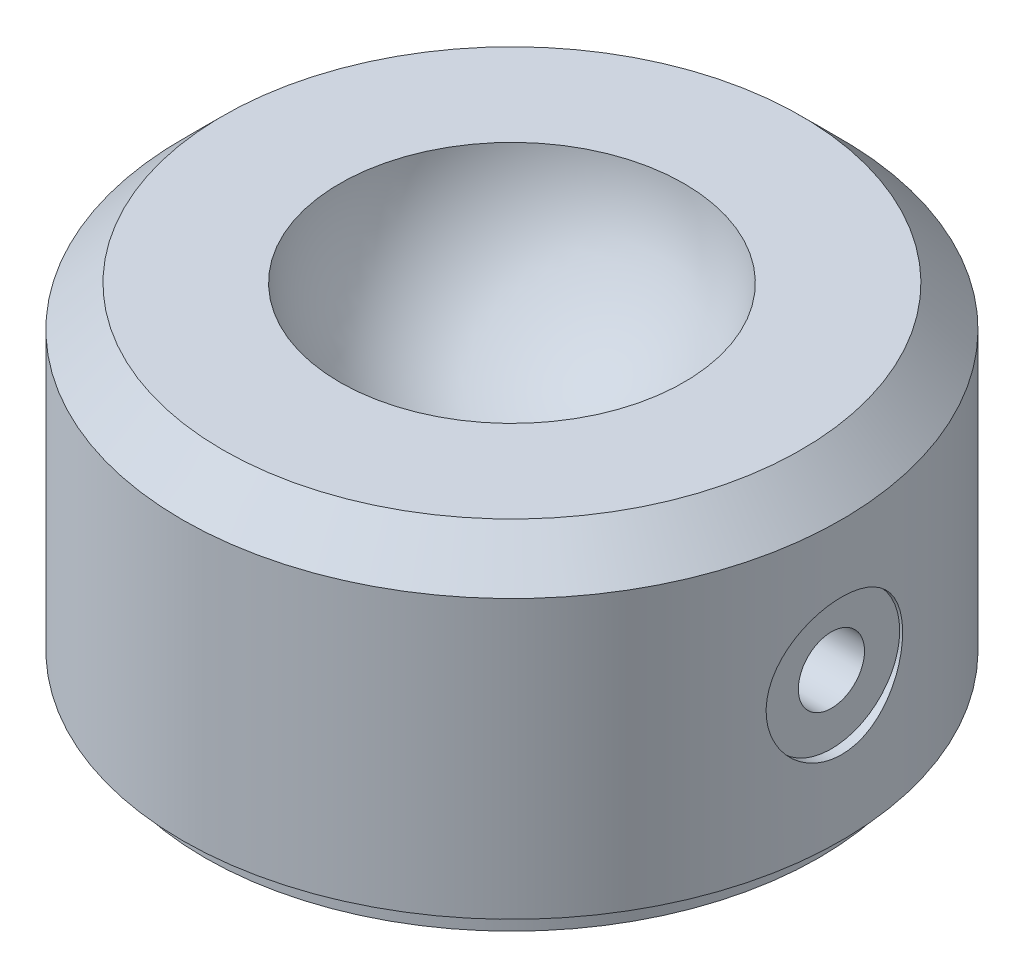
ISO-10303-21;
HEADER;
FILE_DESCRIPTION(('STEP AP214'),'2;1');
FILE_NAME('part.step','',(''),(''),'','','');
FILE_SCHEMA(('AUTOMOTIVE_DESIGN { 1 0 10303 214 1 1 1 1 }'));
ENDSEC;
DATA;
#1=APPLICATION_CONTEXT('core data for automotive mechanical design processes');
#2=APPLICATION_PROTOCOL_DEFINITION('international standard','automotive_design',2000,#1);
#3=PRODUCT_CONTEXT('',#1,'mechanical');
#4=PRODUCT('Part','Part','',(#3));
#5=PRODUCT_RELATED_PRODUCT_CATEGORY('part','',(#4));
#6=PRODUCT_DEFINITION_FORMATION('','',#4);
#7=PRODUCT_DEFINITION_CONTEXT('part definition',#1,'design');
#8=PRODUCT_DEFINITION('design','',#6,#7);
#9=PRODUCT_DEFINITION_SHAPE('','',#8);
#10=(LENGTH_UNIT() NAMED_UNIT(*) SI_UNIT(.MILLI.,.METRE.));
#11=(NAMED_UNIT(*) PLANE_ANGLE_UNIT() SI_UNIT($,.RADIAN.));
#12=(NAMED_UNIT(*) SI_UNIT($,.STERADIAN.) SOLID_ANGLE_UNIT());
#13=UNCERTAINTY_MEASURE_WITH_UNIT(LENGTH_MEASURE(1.E-05),#10,'distance_accuracy_value','');
#14=(GEOMETRIC_REPRESENTATION_CONTEXT(3) GLOBAL_UNCERTAINTY_ASSIGNED_CONTEXT((#13)) GLOBAL_UNIT_ASSIGNED_CONTEXT((#10,
#11,#12)) REPRESENTATION_CONTEXT('',''));
#15=CARTESIAN_POINT('',(0.,0.,0.));
#16=DIRECTION('',(0.,0.,1.));
#17=DIRECTION('',(1.,0.,0.));
#18=AXIS2_PLACEMENT_3D('',#15,#16,#17);
#19=CARTESIAN_POINT('',(0.,6.0071,0.));
#20=DIRECTION('',(0.,1.,0.));
#21=DIRECTION('',(0.,0.,1.));
#22=AXIS2_PLACEMENT_3D('',#19,#20,#21);
#23=PLANE('',#22);
#24=CARTESIAN_POINT('',(0.,6.0071,0.));
#25=DIRECTION('',(0.,1.,0.));
#26=DIRECTION('',(0.,0.,1.));
#27=AXIS2_PLACEMENT_3D('',#24,#25,#26);
#28=CIRCLE('',#27,10.922);
#29=CARTESIAN_POINT('',(0.,6.0071,10.922));
#30=VERTEX_POINT('',#29);
#31=EDGE_CURVE('E84',#30,#30,#28,.T.);
#32=ORIENTED_EDGE('',*,*,#31,.T.);
#33=EDGE_LOOP('',(#32));
#34=FACE_BOUND('',#33,.T.);
#35=CARTESIAN_POINT('',(0.,6.0071,0.));
#36=DIRECTION('',(0.,1.,0.));
#37=DIRECTION('',(0.,0.,1.));
#38=AXIS2_PLACEMENT_3D('',#35,#36,#37);
#39=CIRCLE('',#38,6.5001796436837);
#40=CARTESIAN_POINT('',(0.,6.0071,6.5001796436837));
#41=VERTEX_POINT('',#40);
#42=EDGE_CURVE('E72',#41,#41,#39,.F.);
#43=ORIENTED_EDGE('',*,*,#42,.T.);
#44=EDGE_LOOP('',(#43));
#45=FACE_BOUND('',#44,.T.);
#46=ADVANCED_FACE('F40',(#34,#45),#23,.T.);
#47=CARTESIAN_POINT('',(0.,-6.0071,0.));
#48=DIRECTION('',(0.,1.,0.));
#49=DIRECTION('',(0.,0.,1.));
#50=AXIS2_PLACEMENT_3D('',#47,#48,#49);
#51=PLANE('',#50);
#52=CARTESIAN_POINT('',(0.,-6.0071,0.));
#53=DIRECTION('',(0.,1.,0.));
#54=DIRECTION('',(0.,0.,1.));
#55=AXIS2_PLACEMENT_3D('',#52,#53,#54);
#56=CIRCLE('',#55,12.446);
#57=CARTESIAN_POINT('',(0.,-6.0071,12.446));
#58=VERTEX_POINT('',#57);
#59=EDGE_CURVE('E81',#58,#58,#56,.T.);
#60=ORIENTED_EDGE('',*,*,#59,.F.);
#61=EDGE_LOOP('',(#60));
#62=FACE_BOUND('',#61,.T.);
#63=CARTESIAN_POINT('',(0.,-6.0071,0.));
#64=DIRECTION('',(0.,1.,0.));
#65=DIRECTION('',(0.,0.,1.));
#66=AXIS2_PLACEMENT_3D('',#63,#64,#65);
#67=CIRCLE('',#66,11.5951);
#68=CARTESIAN_POINT('',(0.,-6.0071,11.5951));
#69=VERTEX_POINT('',#68);
#70=EDGE_CURVE('E50',#69,#69,#67,.F.);
#71=ORIENTED_EDGE('',*,*,#70,.F.);
#72=EDGE_LOOP('',(#71));
#73=FACE_BOUND('',#72,.T.);
#74=ADVANCED_FACE('F112',(#62,#73),#51,.F.);
#75=CARTESIAN_POINT('',(0.,6.0071,0.));
#76=DIRECTION('',(0.,-1.,0.));
#77=DIRECTION('',(0.,0.,-1.));
#78=AXIS2_PLACEMENT_3D('',#75,#76,#77);
#79=CYLINDRICAL_SURFACE('',#78,12.446);
#80=CARTESIAN_POINT('',(12.1760550421719,-0.6223,-2.5781));
#81=CARTESIAN_POINT('',(12.1760579161759,-0.765436207380414,-2.57809483831996));
#82=CARTESIAN_POINT('',(12.1786064693682,-0.90863629867503,-2.56613910104311));
#83=CARTESIAN_POINT('',(12.1885089559425,-1.19097753976139,-2.5186765117093));
#84=CARTESIAN_POINT('',(12.195866596214,-1.33011547190427,-2.48315149190922));
#85=CARTESIAN_POINT('',(12.2145190196045,-1.60020702824344,-2.38970579313672));
#86=CARTESIAN_POINT('',(12.2258097359615,-1.73116894205712,-2.33180824041126));
#87=CARTESIAN_POINT('',(12.2510512766012,-1.98151927823464,-2.19532539759628));
#88=CARTESIAN_POINT('',(12.2650019874416,-2.10090819383088,-2.11674098969568));
#89=CARTESIAN_POINT('',(12.2942279247945,-2.32653819900246,-1.93984513553784));
#90=CARTESIAN_POINT('',(12.3095185911322,-2.43257827909951,-1.84127981115731));
#91=CARTESIAN_POINT('',(12.3395659466728,-2.62674359629513,-1.6277683945702));
#92=CARTESIAN_POINT('',(12.3543225969028,-2.71486752802085,-1.51282110980905));
#93=CARTESIAN_POINT('',(12.3818063841349,-2.87148468652724,-1.26847137834301));
#94=CARTESIAN_POINT('',(12.3945131863925,-2.93978602786657,-1.13894345815747));
#95=CARTESIAN_POINT('',(12.4162917638457,-3.05357978129639,-0.869942235671268));
#96=CARTESIAN_POINT('',(12.4253639042794,-3.09907448528449,-0.730469934316673));
#97=CARTESIAN_POINT('',(12.4387418838477,-3.16533537918545,-0.447626676608212));
#98=CARTESIAN_POINT('',(12.4431131435972,-3.18644129718095,-0.304338453464356));
#99=CARTESIAN_POINT('',(12.4468230507835,-3.20438627251898,-0.0161927334004353));
#100=CARTESIAN_POINT('',(12.4461622169122,-3.20122783095367,0.128664600243735));
#101=CARTESIAN_POINT('',(12.4399328297405,-3.17098968951854,0.41349932886032));
#102=CARTESIAN_POINT('',(12.4344393745033,-3.14427601883043,0.553517463978391));
#103=CARTESIAN_POINT('',(12.4192469994913,-3.06826729945782,0.827039534672957));
#104=CARTESIAN_POINT('',(12.4095479029999,-3.01897130188312,0.960543196255941));
#105=CARTESIAN_POINT('',(12.3869113759362,-2.89886389025057,1.21828038659435));
#106=CARTESIAN_POINT('',(12.3739527248129,-2.82791081017113,1.3424459579488));
#107=CARTESIAN_POINT('',(12.3462228265745,-2.66660845054558,1.5772431896656));
#108=CARTESIAN_POINT('',(12.3314513566287,-2.57625678551136,1.6878731828981));
#109=CARTESIAN_POINT('',(12.3013990353313,-2.37671959456915,1.89463292896738));
#110=CARTESIAN_POINT('',(12.2861138233237,-2.26721370825951,1.99045312773948));
#111=CARTESIAN_POINT('',(12.2570173539799,-2.03353131687161,2.16242250552562));
#112=CARTESIAN_POINT('',(12.2432061287331,-1.90935449252311,2.23857125633294));
#113=CARTESIAN_POINT('',(12.2186116671616,-1.64938990506203,2.36915424036746));
#114=CARTESIAN_POINT('',(12.2078358700401,-1.51357466191361,2.42353526026166));
#115=CARTESIAN_POINT('',(12.1906390490583,-1.23445899908573,2.50861291968142));
#116=CARTESIAN_POINT('',(12.1842174124135,-1.09115963574561,2.53931289205279));
#117=CARTESIAN_POINT('',(12.1765796006449,-0.803957606580551,2.57568787674998));
#118=CARTESIAN_POINT('',(12.1752701658251,-0.660114147681981,2.58181128744164));
#119=CARTESIAN_POINT('',(12.1777542242031,-0.373461419385834,2.57006867321218));
#120=CARTESIAN_POINT('',(12.1815474055359,-0.230652087320149,2.55220411440327));
#121=CARTESIAN_POINT('',(12.1937216925506,0.0483513629252177,2.4933801744909));
#122=CARTESIAN_POINT('',(12.2020546338063,0.184598864100105,2.45266311160834));
#123=CARTESIAN_POINT('',(12.2223268439924,0.448338083949179,2.34955027905924));
#124=CARTESIAN_POINT('',(12.2342664281927,0.575829035985054,2.28715261414016));
#125=CARTESIAN_POINT('',(12.2606144342395,0.820390213673221,2.1414449082384));
#126=CARTESIAN_POINT('',(12.2750549030789,0.937290716863754,2.05785590904265));
#127=CARTESIAN_POINT('',(12.3046909578144,1.15556954868998,1.87250761317661));
#128=CARTESIAN_POINT('',(12.3198866272287,1.25694615544662,1.77074630357828));
#129=CARTESIAN_POINT('',(12.3496253597795,1.44301453809699,1.54992303714825));
#130=CARTESIAN_POINT('',(12.3641534472041,1.52740218823971,1.43060247123221));
#131=CARTESIAN_POINT('',(12.3906542194833,1.67493350358039,1.17921771282571));
#132=CARTESIAN_POINT('',(12.402627016461,1.73807810096892,1.04715407985561));
#133=CARTESIAN_POINT('',(12.4226045412503,1.84089487513778,0.774807222998114));
#134=CARTESIAN_POINT('',(12.4306327670947,1.88070632976634,0.634578380381921));
#135=CARTESIAN_POINT('',(12.4419176813876,1.93616581255276,0.349239790883253));
#136=CARTESIAN_POINT('',(12.4451749884417,1.95181697339006,0.204130679281228));
#137=CARTESIAN_POINT('',(12.4465350367286,1.95838297950394,-0.0839511458295016));
#138=CARTESIAN_POINT('',(12.4447328087927,1.94975386268994,-0.226913210670867));
#139=CARTESIAN_POINT('',(12.4363774997964,1.90901606584936,-0.509302662902665));
#140=CARTESIAN_POINT('',(12.4298244876157,1.87690772623875,-0.648730101509922));
#141=CARTESIAN_POINT('',(12.4127082238895,1.79033164868514,-0.919782733473749));
#142=CARTESIAN_POINT('',(12.4021554686694,1.73592240373113,-1.05142731458867));
#143=CARTESIAN_POINT('',(12.3781724334103,1.60634857398583,-1.30378245836165));
#144=CARTESIAN_POINT('',(12.3647419061504,1.53118220585057,-1.42449208036103));
#145=CARTESIAN_POINT('',(12.3361855985561,1.36070851278772,-1.65379460366482));
#146=CARTESIAN_POINT('',(12.3210346300185,1.2650769559567,-1.7621433452447));
#147=CARTESIAN_POINT('',(12.290889342249,1.05704928042233,-1.96141172964145));
#148=CARTESIAN_POINT('',(12.2758950611875,0.94464917415227,-2.05232721504011));
#149=CARTESIAN_POINT('',(12.2475665256637,0.704693493058984,-2.21516586524022));
#150=CARTESIAN_POINT('',(12.2342537777349,0.576975788583818,-2.28685404202271));
#151=CARTESIAN_POINT('',(12.2110610187779,0.311063433550885,-2.40763724478487));
#152=CARTESIAN_POINT('',(12.2011779725164,0.172878179259104,-2.45675226021834));
#153=CARTESIAN_POINT('',(12.1878827886588,-0.0750152366852909,-2.52174952733032));
#154=CARTESIAN_POINT('',(12.1834755854465,-0.183334047058352,-2.54284215363119));
#155=CARTESIAN_POINT('',(12.1775606625411,-0.401855989640944,-2.57101910185683));
#156=CARTESIAN_POINT('',(12.1760528286654,-0.512059047472776,-2.57810397543386));
#157=CARTESIAN_POINT('',(12.1760550421719,-0.6223,-2.5781));
#158=B_SPLINE_CURVE_WITH_KNOTS('',3,(#80,#81,#82,#83,#84,#85,#86,#87,#88,#89,#90,#91,#92,#93,
#94,#95,#96,#97,#98,#99,#100,#101,#102,#103,#104,#105,#106,#107,#108,#109,#110,#111,#112,#113,
#114,#115,#116,#117,#118,#119,#120,#121,#122,#123,#124,#125,#126,#127,#128,#129,#130,#131,#132,
#133,#134,#135,#136,#137,#138,#139,#140,#141,#142,#143,#144,#145,#146,#147,#148,#149,#150,#151,
#152,#153,#154,#155,#156,#157),.UNSPECIFIED.,.T.,.F.,(4,2,2,2,2,2,2,2,2,2,2,2,2,2,2,2,2,2,2,2,2,
2,2,2,2,2,2,2,2,2,2,2,2,2,2,2,2,2,4),(0.,0.429004840637051,0.858340752836482,1.2872340472138,
1.7161090544405,2.15081981877327,2.58556224484574,3.02438247108148,3.46315859030008,
3.89574607910363,4.32828897877823,4.75422667635459,5.18018227311349,5.6089861685691,
6.03784282524809,6.47471250536546,6.91159169443083,7.34953244858169,7.78741155615859,
8.21726423529409,8.64709064361183,9.07244319693337,9.49783294264497,9.92914297133646,
10.360500805462,10.799002443575,11.2374848367882,11.6733225025921,12.1091036519305,
12.5367547863127,12.9643997204731,13.3909300915463,13.8174971192956,14.2514021852283,
14.6854105988902,15.1245037422822,15.5632072980432,15.8936321833431,16.2240440556161),.UNSPECIFIED.);
#159=CARTESIAN_POINT('',(12.1760550421719,-0.6223,-2.5781));
#160=VERTEX_POINT('',#159);
#161=EDGE_CURVE('E11',#160,#160,#158,.T.);
#162=ORIENTED_EDGE('',*,*,#161,.T.);
#163=EDGE_LOOP('',(#162));
#164=FACE_BOUND('',#163,.T.);
#165=CARTESIAN_POINT('',(0.,4.4831,0.));
#166=DIRECTION('',(0.,1.,0.));
#167=DIRECTION('',(0.,0.,1.));
#168=AXIS2_PLACEMENT_3D('',#165,#166,#167);
#169=CIRCLE('',#168,12.446);
#170=CARTESIAN_POINT('',(0.,4.4831,12.446));
#171=VERTEX_POINT('',#170);
#172=EDGE_CURVE('E87',#171,#171,#169,.F.);
#173=ORIENTED_EDGE('',*,*,#172,.T.);
#174=EDGE_LOOP('',(#173));
#175=FACE_BOUND('',#174,.T.);
#176=ORIENTED_EDGE('',*,*,#59,.T.);
#177=EDGE_LOOP('',(#176));
#178=FACE_BOUND('',#177,.T.);
#179=ADVANCED_FACE('F118',(#164,#175,#178),#79,.T.);
#180=CARTESIAN_POINT('',(0.,6.0071,0.));
#181=DIRECTION('',(0.,-1.,0.));
#182=DIRECTION('',(0.,0.,-1.));
#183=AXIS2_PLACEMENT_3D('',#180,#181,#182);
#184=CONICAL_SURFACE('',#183,10.922,0.785398163397448);
#185=ORIENTED_EDGE('',*,*,#172,.F.);
#186=EDGE_LOOP('',(#185));
#187=FACE_BOUND('',#186,.T.);
#188=ORIENTED_EDGE('',*,*,#31,.F.);
#189=EDGE_LOOP('',(#188));
#190=FACE_BOUND('',#189,.T.);
#191=ADVANCED_FACE('F42',(#187,#190),#184,.T.);
#192=CARTESIAN_POINT('',(0.,-6.99786,0.));
#193=DIRECTION('',(0.,1.,0.));
#194=DIRECTION('',(0.,0.,1.));
#195=AXIS2_PLACEMENT_3D('',#192,#193,#194);
#196=CYLINDRICAL_SURFACE('',#195,11.5951);
#197=CARTESIAN_POINT('',(0.,-6.99786,0.));
#198=DIRECTION('',(0.,-1.,0.));
#199=DIRECTION('',(0.,0.,-1.));
#200=AXIS2_PLACEMENT_3D('',#197,#198,#199);
#201=CIRCLE('',#200,11.5951);
#202=CARTESIAN_POINT('',(0.,-6.99786,-11.5951));
#203=VERTEX_POINT('',#202);
#204=EDGE_CURVE('E78',#203,#203,#201,.T.);
#205=ORIENTED_EDGE('',*,*,#204,.F.);
#206=EDGE_LOOP('',(#205));
#207=FACE_BOUND('',#206,.T.);
#208=ORIENTED_EDGE('',*,*,#70,.T.);
#209=EDGE_LOOP('',(#208));
#210=FACE_BOUND('',#209,.T.);
#211=ADVANCED_FACE('F123',(#207,#210),#196,.T.);
#212=CARTESIAN_POINT('',(0.,-6.99786,0.));
#213=DIRECTION('',(0.,-1.,0.));
#214=DIRECTION('',(0.,0.,-1.));
#215=AXIS2_PLACEMENT_3D('',#212,#213,#214);
#216=PLANE('',#215);
#217=ORIENTED_EDGE('',*,*,#204,.T.);
#218=EDGE_LOOP('',(#217));
#219=FACE_BOUND('',#218,.T.);
#220=ADVANCED_FACE('F140',(#219),#216,.T.);
#221=CARTESIAN_POINT('',(0.,6.5151,0.));
#222=DIRECTION('',(0.,1.,0.));
#223=DIRECTION('',(1.,0.,0.));
#224=AXIS2_PLACEMENT_3D('',#221,#222,#223);
#225=SPHERICAL_SURFACE('',#224,6.519999954);
#226=ORIENTED_EDGE('',*,*,#42,.F.);
#227=EDGE_LOOP('',(#226));
#228=FACE_BOUND('',#227,.T.);
#229=CARTESIAN_POINT('',(0.,0.191316073413008,0.));
#230=DIRECTION('',(0.,1.,0.));
#231=DIRECTION('',(0.,0.,1.));
#232=AXIS2_PLACEMENT_3D('',#229,#230,#231);
#233=CIRCLE('',#232,1.5875);
#234=CARTESIAN_POINT('',(0.,0.191316073413008,1.5875));
#235=VERTEX_POINT('',#234);
#236=EDGE_CURVE('E67',#235,#235,#233,.F.);
#237=ORIENTED_EDGE('',*,*,#236,.T.);
#238=EDGE_LOOP('',(#237));
#239=FACE_BOUND('',#238,.T.);
#240=ADVANCED_FACE('F94',(#228,#239),#225,.F.);
#241=CARTESIAN_POINT('',(0.,-0.3683,0.));
#242=DIRECTION('',(0.,1.,0.));
#243=DIRECTION('',(0.,0.,1.));
#244=AXIS2_PLACEMENT_3D('',#241,#242,#243);
#245=PLANE('',#244);
#246=CARTESIAN_POINT('',(0.,-0.3683,0.));
#247=DIRECTION('',(0.,1.,0.));
#248=DIRECTION('',(0.,0.,1.));
#249=AXIS2_PLACEMENT_3D('',#246,#247,#248);
#250=CIRCLE('',#249,1.5875);
#251=CARTESIAN_POINT('',(0.,-0.3683,1.5875));
#252=VERTEX_POINT('',#251);
#253=EDGE_CURVE('E75',#252,#252,#250,.T.);
#254=ORIENTED_EDGE('',*,*,#253,.T.);
#255=EDGE_LOOP('',(#254));
#256=FACE_BOUND('',#255,.T.);
#257=ADVANCED_FACE('F99',(#256),#245,.T.);
#258=CARTESIAN_POINT('',(0.,-0.3683,0.));
#259=DIRECTION('',(0.,1.,0.));
#260=DIRECTION('',(0.,0.,1.));
#261=AXIS2_PLACEMENT_3D('',#258,#259,#260);
#262=CYLINDRICAL_SURFACE('',#261,1.5875);
#263=ORIENTED_EDGE('',*,*,#253,.F.);
#264=EDGE_LOOP('',(#263));
#265=FACE_BOUND('',#264,.T.);
#266=ORIENTED_EDGE('',*,*,#236,.F.);
#267=EDGE_LOOP('',(#266));
#268=FACE_BOUND('',#267,.T.);
#269=ADVANCED_FACE('F96',(#265,#268),#262,.F.);
#270=CARTESIAN_POINT('',(12.446,-0.6223,0.));
#271=DIRECTION('',(1.,0.,0.));
#272=DIRECTION('',(0.,0.,-1.));
#273=AXIS2_PLACEMENT_3D('',#270,#271,#272);
#274=CYLINDRICAL_SURFACE('',#273,2.5781);
#275=CARTESIAN_POINT('',(12.065,-0.6223,0.));
#276=DIRECTION('',(1.,0.,0.));
#277=DIRECTION('',(0.,0.,-1.));
#278=AXIS2_PLACEMENT_3D('',#275,#276,#277);
#279=CIRCLE('',#278,2.5781);
#280=CARTESIAN_POINT('',(12.065,-0.6223,-2.5781));
#281=VERTEX_POINT('',#280);
#282=EDGE_CURVE('E63',#281,#281,#279,.T.);
#283=ORIENTED_EDGE('',*,*,#282,.F.);
#284=EDGE_LOOP('',(#283));
#285=FACE_BOUND('',#284,.T.);
#286=ORIENTED_EDGE('',*,*,#161,.F.);
#287=EDGE_LOOP('',(#286));
#288=FACE_BOUND('',#287,.T.);
#289=ADVANCED_FACE('F98',(#285,#288),#274,.F.);
#290=CARTESIAN_POINT('',(12.065,-0.6223,0.));
#291=DIRECTION('',(-1.,0.,0.));
#292=DIRECTION('',(0.,0.,1.));
#293=AXIS2_PLACEMENT_3D('',#290,#291,#292);
#294=PLANE('',#293);
#295=CARTESIAN_POINT('',(12.065,-0.6223,0.));
#296=DIRECTION('',(1.,0.,0.));
#297=DIRECTION('',(0.,0.,-1.));
#298=AXIS2_PLACEMENT_3D('',#295,#296,#297);
#299=CIRCLE('',#298,1.24999999999999);
#300=CARTESIAN_POINT('',(12.065,-0.6223,-1.24999999999999));
#301=VERTEX_POINT('',#300);
#302=EDGE_CURVE('E64',#301,#301,#299,.T.);
#303=ORIENTED_EDGE('',*,*,#302,.F.);
#304=EDGE_LOOP('',(#303));
#305=FACE_BOUND('',#304,.T.);
#306=ORIENTED_EDGE('',*,*,#282,.T.);
#307=EDGE_LOOP('',(#306));
#308=FACE_BOUND('',#307,.T.);
#309=ADVANCED_FACE('F57',(#305,#308),#294,.F.);
#310=CARTESIAN_POINT('',(6.7564,-0.6223,0.));
#311=DIRECTION('',(1.,0.,0.));
#312=DIRECTION('',(0.,0.,-1.));
#313=AXIS2_PLACEMENT_3D('',#310,#311,#312);
#314=CONICAL_SURFACE('',#313,1.25,1.02974425867665);
#315=CARTESIAN_POINT('',(6.00532422621555,-0.622300000000001,0.));
#316=VERTEX_POINT('',#315);
#317=VERTEX_LOOP('',#316);
#318=FACE_BOUND('',#317,.T.);
#319=CARTESIAN_POINT('',(6.7564,-0.6223,0.));
#320=DIRECTION('',(1.,0.,0.));
#321=DIRECTION('',(0.,0.,-1.));
#322=AXIS2_PLACEMENT_3D('',#319,#320,#321);
#323=CIRCLE('',#322,1.25);
#324=CARTESIAN_POINT('',(6.7564,-0.6223,-1.25));
#325=VERTEX_POINT('',#324);
#326=EDGE_CURVE('E61',#325,#325,#323,.T.);
#327=ORIENTED_EDGE('',*,*,#326,.T.);
#328=EDGE_LOOP('',(#327));
#329=FACE_BOUND('',#328,.T.);
#330=ADVANCED_FACE('F53',(#318,#329),#314,.F.);
#331=CARTESIAN_POINT('',(12.065,-0.6223,0.));
#332=DIRECTION('',(1.,0.,0.));
#333=DIRECTION('',(0.,0.,-1.));
#334=AXIS2_PLACEMENT_3D('',#331,#332,#333);
#335=CYLINDRICAL_SURFACE('',#334,1.25);
#336=ORIENTED_EDGE('',*,*,#326,.F.);
#337=EDGE_LOOP('',(#336));
#338=FACE_BOUND('',#337,.T.);
#339=ORIENTED_EDGE('',*,*,#302,.T.);
#340=EDGE_LOOP('',(#339));
#341=FACE_BOUND('',#340,.T.);
#342=ADVANCED_FACE('F56',(#338,#341),#335,.F.);
#343=CLOSED_SHELL('',(#46,#74,#179,#191,#211,#220,#240,#257,#269,#289,#309,#330,#342));
#344=MANIFOLD_SOLID_BREP('B2',#343);
#345=ADVANCED_BREP_SHAPE_REPRESENTATION('',(#18,#344),#14);
#346=SHAPE_DEFINITION_REPRESENTATION(#9,#345);
ENDSEC;
END-ISO-10303-21;
